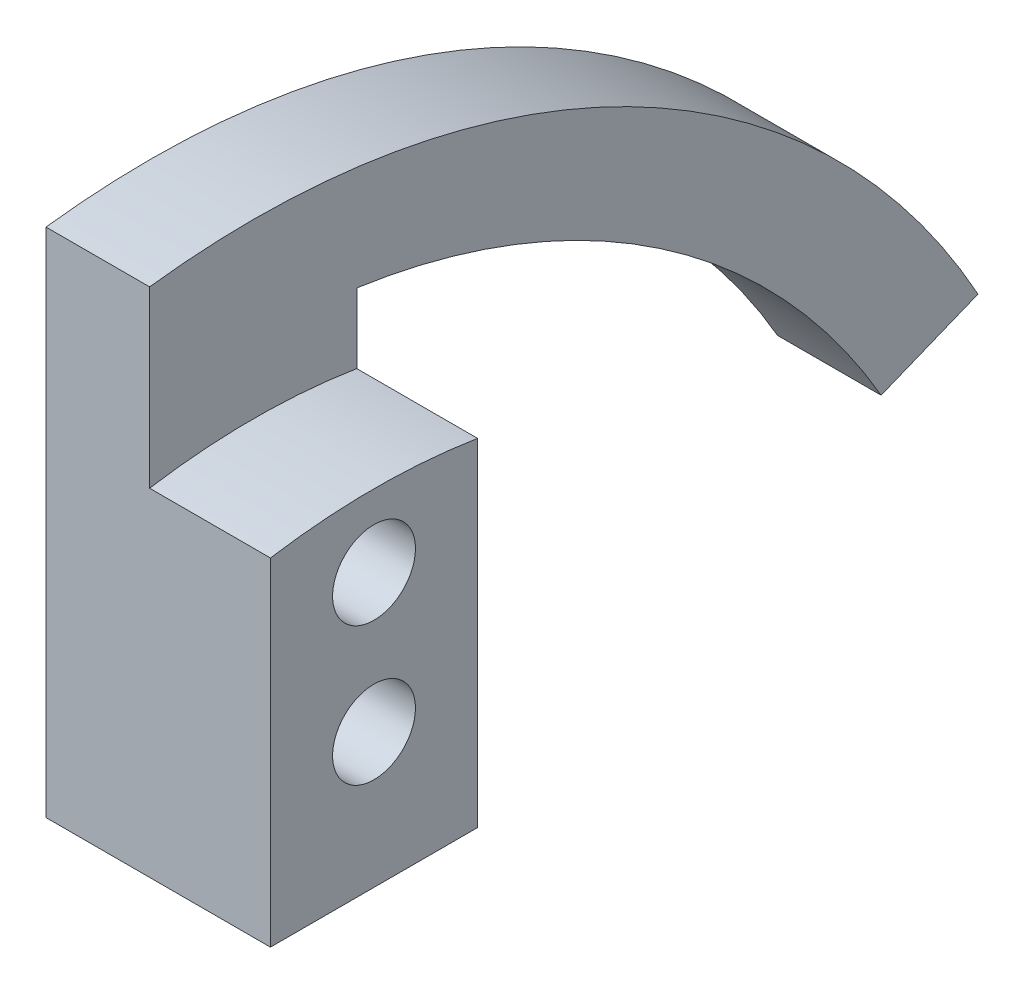
ISO-10303-21;
HEADER;
FILE_DESCRIPTION(('STEP AP214'),'2;1');
FILE_NAME('part.step','',(''),(''),'','','');
FILE_SCHEMA(('AUTOMOTIVE_DESIGN { 1 0 10303 214 1 1 1 1 }'));
ENDSEC;
DATA;
#1=APPLICATION_CONTEXT('core data for automotive mechanical design processes');
#2=APPLICATION_PROTOCOL_DEFINITION('international standard','automotive_design',2000,#1);
#3=PRODUCT_CONTEXT('',#1,'mechanical');
#4=PRODUCT('Part','Part','',(#3));
#5=PRODUCT_RELATED_PRODUCT_CATEGORY('part','',(#4));
#6=PRODUCT_DEFINITION_FORMATION('','',#4);
#7=PRODUCT_DEFINITION_CONTEXT('part definition',#1,'design');
#8=PRODUCT_DEFINITION('design','',#6,#7);
#9=PRODUCT_DEFINITION_SHAPE('','',#8);
#10=(LENGTH_UNIT() NAMED_UNIT(*) SI_UNIT(.MILLI.,.METRE.));
#11=(NAMED_UNIT(*) PLANE_ANGLE_UNIT() SI_UNIT($,.RADIAN.));
#12=(NAMED_UNIT(*) SI_UNIT($,.STERADIAN.) SOLID_ANGLE_UNIT());
#13=UNCERTAINTY_MEASURE_WITH_UNIT(LENGTH_MEASURE(1.E-05),#10,'distance_accuracy_value','');
#14=(GEOMETRIC_REPRESENTATION_CONTEXT(3) GLOBAL_UNCERTAINTY_ASSIGNED_CONTEXT((#13)) GLOBAL_UNIT_ASSIGNED_CONTEXT((#10,
#11,#12)) REPRESENTATION_CONTEXT('',''));
#15=CARTESIAN_POINT('',(0.,0.,0.));
#16=DIRECTION('',(0.,0.,1.));
#17=DIRECTION('',(1.,0.,0.));
#18=AXIS2_PLACEMENT_3D('',#15,#16,#17);
#19=CARTESIAN_POINT('',(1.5,0.,0.));
#20=DIRECTION('',(1.,0.,0.));
#21=DIRECTION('',(0.,0.,-1.));
#22=AXIS2_PLACEMENT_3D('',#19,#20,#21);
#23=PLANE('',#22);
#24=CARTESIAN_POINT('',(1.5,0.,0.));
#25=DIRECTION('',(1.,0.,0.));
#26=DIRECTION('',(0.,0.,-1.));
#27=AXIS2_PLACEMENT_3D('',#24,#25,#26);
#28=CIRCLE('',#27,9.5);
#29=CARTESIAN_POINT('',(1.5,9.38083151964686,-1.5));
#30=VERTEX_POINT('',#29);
#31=CARTESIAN_POINT('',(1.5,9.38083151964686,1.5));
#32=VERTEX_POINT('',#31);
#33=EDGE_CURVE('E48',#30,#32,#28,.T.);
#34=ORIENTED_EDGE('',*,*,#33,.F.);
#35=DIRECTION('',(0.,1.,0.));
#36=VECTOR('',#35,1.);
#37=CARTESIAN_POINT('',(1.5,4.5,-1.5));
#38=LINE('',#37,#36);
#39=CARTESIAN_POINT('',(1.5,10.3923048454133,-1.5));
#40=VERTEX_POINT('',#39);
#41=EDGE_CURVE('E86',#30,#40,#38,.T.);
#42=ORIENTED_EDGE('',*,*,#41,.T.);
#43=CARTESIAN_POINT('',(1.5,0.,0.));
#44=DIRECTION('',(-1.,0.,0.));
#45=DIRECTION('',(0.,0.,-1.));
#46=AXIS2_PLACEMENT_3D('',#43,#44,#45);
#47=CIRCLE('',#46,10.5);
#48=CARTESIAN_POINT('',(1.5,5.25000000000001,-9.0932667397366));
#49=VERTEX_POINT('',#48);
#50=EDGE_CURVE('E146',#40,#49,#47,.T.);
#51=ORIENTED_EDGE('',*,*,#50,.T.);
#52=DIRECTION('',(0.,0.374606593415913,-0.927183854566787));
#53=VECTOR('',#52,1.);
#54=CARTESIAN_POINT('',(1.5,5.25000000000001,-9.0932667397366));
#55=LINE('',#54,#53);
#56=CARTESIAN_POINT('',(1.5,5.81673328559829,-10.4959808443143));
#57=VERTEX_POINT('',#56);
#58=EDGE_CURVE('E148',#49,#57,#55,.T.);
#59=ORIENTED_EDGE('',*,*,#58,.T.);
#60=CARTESIAN_POINT('',(1.5,0.,0.));
#61=DIRECTION('',(1.,0.,0.));
#62=DIRECTION('',(0.,0.,-1.));
#63=AXIS2_PLACEMENT_3D('',#60,#61,#62);
#64=CIRCLE('',#63,12.);
#65=CARTESIAN_POINT('',(1.5,11.9058808997907,1.5));
#66=VERTEX_POINT('',#65);
#67=EDGE_CURVE('E55',#57,#66,#64,.T.);
#68=ORIENTED_EDGE('',*,*,#67,.T.);
#69=DIRECTION('',(0.,-1.,0.));
#70=VECTOR('',#69,1.);
#71=CARTESIAN_POINT('',(1.5,4.5,1.5));
#72=LINE('',#71,#70);
#73=EDGE_CURVE('E143',#66,#32,#72,.T.);
#74=ORIENTED_EDGE('',*,*,#73,.T.);
#75=EDGE_LOOP('',(#34,#42,#51,#59,#68,#74));
#76=FACE_BOUND('',#75,.T.);
#77=ADVANCED_FACE('F33',(#76),#23,.T.);
#78=CARTESIAN_POINT('',(0.,0.,0.));
#79=DIRECTION('',(1.,0.,0.));
#80=DIRECTION('',(0.,0.,-1.));
#81=AXIS2_PLACEMENT_3D('',#78,#79,#80);
#82=PLANE('',#81);
#83=DIRECTION('',(0.,-1.,0.));
#84=VECTOR('',#83,1.);
#85=CARTESIAN_POINT('',(0.,4.5,1.5));
#86=LINE('',#85,#84);
#87=CARTESIAN_POINT('',(0.,11.9058808997907,1.5));
#88=VERTEX_POINT('',#87);
#89=CARTESIAN_POINT('',(0.,4.5,1.5));
#90=VERTEX_POINT('',#89);
#91=EDGE_CURVE('E109',#88,#90,#86,.T.);
#92=ORIENTED_EDGE('',*,*,#91,.F.);
#93=CARTESIAN_POINT('',(0.,0.,0.));
#94=DIRECTION('',(1.,0.,0.));
#95=DIRECTION('',(0.,0.,-1.));
#96=AXIS2_PLACEMENT_3D('',#93,#94,#95);
#97=CIRCLE('',#96,12.);
#98=CARTESIAN_POINT('',(0.,5.81673328559829,-10.4959808443143));
#99=VERTEX_POINT('',#98);
#100=EDGE_CURVE('E82',#99,#88,#97,.T.);
#101=ORIENTED_EDGE('',*,*,#100,.F.);
#102=DIRECTION('',(0.,0.374606593415913,-0.927183854566787));
#103=VECTOR('',#102,1.);
#104=CARTESIAN_POINT('',(0.,5.25000000000001,-9.0932667397366));
#105=LINE('',#104,#103);
#106=CARTESIAN_POINT('',(0.,5.25000000000001,-9.0932667397366));
#107=VERTEX_POINT('',#106);
#108=EDGE_CURVE('E159',#107,#99,#105,.T.);
#109=ORIENTED_EDGE('',*,*,#108,.F.);
#110=CARTESIAN_POINT('',(0.,0.,0.));
#111=DIRECTION('',(-1.,0.,0.));
#112=DIRECTION('',(0.,0.,-1.));
#113=AXIS2_PLACEMENT_3D('',#110,#111,#112);
#114=CIRCLE('',#113,10.5);
#115=CARTESIAN_POINT('',(0.,10.3923048454133,-1.5));
#116=VERTEX_POINT('',#115);
#117=EDGE_CURVE('E157',#116,#107,#114,.T.);
#118=ORIENTED_EDGE('',*,*,#117,.F.);
#119=DIRECTION('',(0.,1.,0.));
#120=VECTOR('',#119,1.);
#121=CARTESIAN_POINT('',(0.,4.5,-1.5));
#122=LINE('',#121,#120);
#123=CARTESIAN_POINT('',(0.,4.5,-1.5));
#124=VERTEX_POINT('',#123);
#125=EDGE_CURVE('E155',#124,#116,#122,.T.);
#126=ORIENTED_EDGE('',*,*,#125,.F.);
#127=DIRECTION('',(0.,0.,-1.));
#128=VECTOR('',#127,1.);
#129=CARTESIAN_POINT('',(0.,4.5,1.5));
#130=LINE('',#129,#128);
#131=EDGE_CURVE('E153',#90,#124,#130,.T.);
#132=ORIENTED_EDGE('',*,*,#131,.F.);
#133=EDGE_LOOP('',(#92,#101,#109,#118,#126,#132));
#134=FACE_BOUND('',#133,.T.);
#135=CARTESIAN_POINT('',(0.,8.45,0.));
#136=DIRECTION('',(1.,0.,0.));
#137=DIRECTION('',(0.,0.,-1.));
#138=AXIS2_PLACEMENT_3D('',#135,#136,#137);
#139=CIRCLE('',#138,0.6);
#140=CARTESIAN_POINT('',(0.,8.45,-0.6));
#141=VERTEX_POINT('',#140);
#142=EDGE_CURVE('E140',#141,#141,#139,.T.);
#143=ORIENTED_EDGE('',*,*,#142,.T.);
#144=EDGE_LOOP('',(#143));
#145=FACE_BOUND('',#144,.T.);
#146=CARTESIAN_POINT('',(0.,6.45,0.));
#147=DIRECTION('',(1.,0.,0.));
#148=DIRECTION('',(0.,0.,-1.));
#149=AXIS2_PLACEMENT_3D('',#146,#147,#148);
#150=CIRCLE('',#149,0.6);
#151=CARTESIAN_POINT('',(0.,6.45,-0.6));
#152=VERTEX_POINT('',#151);
#153=EDGE_CURVE('E137',#152,#152,#150,.T.);
#154=ORIENTED_EDGE('',*,*,#153,.T.);
#155=EDGE_LOOP('',(#154));
#156=FACE_BOUND('',#155,.T.);
#157=ADVANCED_FACE('F176',(#134,#145,#156),#82,.F.);
#158=CARTESIAN_POINT('',(1.5,4.5,1.5));
#159=DIRECTION('',(0.,0.,-1.));
#160=DIRECTION('',(0.,1.,0.));
#161=AXIS2_PLACEMENT_3D('',#158,#159,#160);
#162=PLANE('',#161);
#163=ORIENTED_EDGE('',*,*,#91,.T.);
#164=DIRECTION('',(-1.,0.,0.));
#165=VECTOR('',#164,1.);
#166=CARTESIAN_POINT('',(1.5,4.5,1.5));
#167=LINE('',#166,#165);
#168=CARTESIAN_POINT('',(3.25,4.5,1.5));
#169=VERTEX_POINT('',#168);
#170=EDGE_CURVE('E11',#169,#90,#167,.T.);
#171=ORIENTED_EDGE('',*,*,#170,.F.);
#172=DIRECTION('',(0.,-1.,0.));
#173=VECTOR('',#172,1.);
#174=CARTESIAN_POINT('',(3.25,9.38083151964686,1.5));
#175=LINE('',#174,#173);
#176=CARTESIAN_POINT('',(3.25,9.38083151964686,1.5));
#177=VERTEX_POINT('',#176);
#178=EDGE_CURVE('E107',#177,#169,#175,.T.);
#179=ORIENTED_EDGE('',*,*,#178,.F.);
#180=DIRECTION('',(-1.,0.,0.));
#181=VECTOR('',#180,1.);
#182=CARTESIAN_POINT('',(3.25,9.38083151964686,1.5));
#183=LINE('',#182,#181);
#184=EDGE_CURVE('E131',#177,#32,#183,.T.);
#185=ORIENTED_EDGE('',*,*,#184,.T.);
#186=ORIENTED_EDGE('',*,*,#73,.F.);
#187=DIRECTION('',(-1.,0.,0.));
#188=VECTOR('',#187,1.);
#189=CARTESIAN_POINT('',(1.5,11.9058808997907,1.5));
#190=LINE('',#189,#188);
#191=EDGE_CURVE('E151',#66,#88,#190,.T.);
#192=ORIENTED_EDGE('',*,*,#191,.T.);
#193=EDGE_LOOP('',(#163,#171,#179,#185,#186,#192));
#194=FACE_BOUND('',#193,.T.);
#195=ADVANCED_FACE('F35',(#194),#162,.F.);
#196=CARTESIAN_POINT('',(1.5,4.5,1.5));
#197=DIRECTION('',(0.,1.,0.));
#198=DIRECTION('',(0.,0.,1.));
#199=AXIS2_PLACEMENT_3D('',#196,#197,#198);
#200=PLANE('',#199);
#201=ORIENTED_EDGE('',*,*,#131,.T.);
#202=DIRECTION('',(-1.,0.,0.));
#203=VECTOR('',#202,1.);
#204=CARTESIAN_POINT('',(1.5,4.5,-1.5));
#205=LINE('',#204,#203);
#206=CARTESIAN_POINT('',(3.25,4.5,-1.5));
#207=VERTEX_POINT('',#206);
#208=EDGE_CURVE('E41',#207,#124,#205,.T.);
#209=ORIENTED_EDGE('',*,*,#208,.F.);
#210=DIRECTION('',(0.,0.,-1.));
#211=VECTOR('',#210,1.);
#212=CARTESIAN_POINT('',(3.25,4.5,1.5));
#213=LINE('',#212,#211);
#214=EDGE_CURVE('E112',#169,#207,#213,.T.);
#215=ORIENTED_EDGE('',*,*,#214,.F.);
#216=ORIENTED_EDGE('',*,*,#170,.T.);
#217=EDGE_LOOP('',(#201,#209,#215,#216));
#218=FACE_BOUND('',#217,.T.);
#219=ADVANCED_FACE('F113',(#218),#200,.F.);
#220=CARTESIAN_POINT('',(1.5,4.5,-1.5));
#221=DIRECTION('',(0.,0.,1.));
#222=DIRECTION('',(0.,-1.,0.));
#223=AXIS2_PLACEMENT_3D('',#220,#221,#222);
#224=PLANE('',#223);
#225=ORIENTED_EDGE('',*,*,#125,.T.);
#226=DIRECTION('',(-1.,0.,0.));
#227=VECTOR('',#226,1.);
#228=CARTESIAN_POINT('',(1.5,10.3923048454133,-1.5));
#229=LINE('',#228,#227);
#230=EDGE_CURVE('E168',#40,#116,#229,.T.);
#231=ORIENTED_EDGE('',*,*,#230,.F.);
#232=ORIENTED_EDGE('',*,*,#41,.F.);
#233=DIRECTION('',(-1.,0.,0.));
#234=VECTOR('',#233,1.);
#235=CARTESIAN_POINT('',(3.25,9.38083151964686,-1.5));
#236=LINE('',#235,#234);
#237=CARTESIAN_POINT('',(3.25,9.38083151964686,-1.5));
#238=VERTEX_POINT('',#237);
#239=EDGE_CURVE('E134',#238,#30,#236,.T.);
#240=ORIENTED_EDGE('',*,*,#239,.F.);
#241=DIRECTION('',(0.,1.,0.));
#242=VECTOR('',#241,1.);
#243=CARTESIAN_POINT('',(3.25,4.5,-1.5));
#244=LINE('',#243,#242);
#245=EDGE_CURVE('E117',#207,#238,#244,.T.);
#246=ORIENTED_EDGE('',*,*,#245,.F.);
#247=ORIENTED_EDGE('',*,*,#208,.T.);
#248=EDGE_LOOP('',(#225,#231,#232,#240,#246,#247));
#249=FACE_BOUND('',#248,.T.);
#250=ADVANCED_FACE('F172',(#249),#224,.F.);
#251=CARTESIAN_POINT('',(1.5,0.,0.));
#252=DIRECTION('',(-1.,0.,0.));
#253=DIRECTION('',(0.,0.,1.));
#254=AXIS2_PLACEMENT_3D('',#251,#252,#253);
#255=CYLINDRICAL_SURFACE('',#254,10.5);
#256=ORIENTED_EDGE('',*,*,#117,.T.);
#257=DIRECTION('',(-1.,0.,0.));
#258=VECTOR('',#257,1.);
#259=CARTESIAN_POINT('',(1.5,5.25000000000001,-9.0932667397366));
#260=LINE('',#259,#258);
#261=EDGE_CURVE('E165',#49,#107,#260,.T.);
#262=ORIENTED_EDGE('',*,*,#261,.F.);
#263=ORIENTED_EDGE('',*,*,#50,.F.);
#264=ORIENTED_EDGE('',*,*,#230,.T.);
#265=EDGE_LOOP('',(#256,#262,#263,#264));
#266=FACE_BOUND('',#265,.T.);
#267=ADVANCED_FACE('F181',(#266),#255,.F.);
#268=CARTESIAN_POINT('',(1.5,5.25000000000001,-9.0932667397366));
#269=DIRECTION('',(0.,0.927183854566787,0.374606593415913));
#270=DIRECTION('',(0.,-0.374606593415913,0.927183854566787));
#271=AXIS2_PLACEMENT_3D('',#268,#269,#270);
#272=PLANE('',#271);
#273=ORIENTED_EDGE('',*,*,#108,.T.);
#274=DIRECTION('',(-1.,0.,0.));
#275=VECTOR('',#274,1.);
#276=CARTESIAN_POINT('',(1.5,5.81673328559829,-10.4959808443143));
#277=LINE('',#276,#275);
#278=EDGE_CURVE('E163',#57,#99,#277,.T.);
#279=ORIENTED_EDGE('',*,*,#278,.F.);
#280=ORIENTED_EDGE('',*,*,#58,.F.);
#281=ORIENTED_EDGE('',*,*,#261,.T.);
#282=EDGE_LOOP('',(#273,#279,#280,#281));
#283=FACE_BOUND('',#282,.T.);
#284=ADVANCED_FACE('F185',(#283),#272,.F.);
#285=CARTESIAN_POINT('',(1.5,0.,0.));
#286=DIRECTION('',(-1.,0.,0.));
#287=DIRECTION('',(0.,0.,1.));
#288=AXIS2_PLACEMENT_3D('',#285,#286,#287);
#289=CYLINDRICAL_SURFACE('',#288,12.);
#290=ORIENTED_EDGE('',*,*,#100,.T.);
#291=ORIENTED_EDGE('',*,*,#191,.F.);
#292=ORIENTED_EDGE('',*,*,#67,.F.);
#293=ORIENTED_EDGE('',*,*,#278,.T.);
#294=EDGE_LOOP('',(#290,#291,#292,#293));
#295=FACE_BOUND('',#294,.T.);
#296=ADVANCED_FACE('F197',(#295),#289,.T.);
#297=CARTESIAN_POINT('',(1.5,8.45,0.));
#298=DIRECTION('',(-1.,0.,0.));
#299=DIRECTION('',(0.,0.,1.));
#300=AXIS2_PLACEMENT_3D('',#297,#298,#299);
#301=CYLINDRICAL_SURFACE('',#300,0.6);
#302=ORIENTED_EDGE('',*,*,#142,.F.);
#303=EDGE_LOOP('',(#302));
#304=FACE_BOUND('',#303,.T.);
#305=CARTESIAN_POINT('',(3.25,8.45,0.));
#306=DIRECTION('',(1.,0.,0.));
#307=DIRECTION('',(0.,0.,-1.));
#308=AXIS2_PLACEMENT_3D('',#305,#306,#307);
#309=CIRCLE('',#308,0.6);
#310=CARTESIAN_POINT('',(3.25,8.45,-0.6));
#311=VERTEX_POINT('',#310);
#312=EDGE_CURVE('E308',#311,#311,#309,.T.);
#313=ORIENTED_EDGE('',*,*,#312,.T.);
#314=EDGE_LOOP('',(#313));
#315=FACE_BOUND('',#314,.T.);
#316=ADVANCED_FACE('F194',(#304,#315),#301,.F.);
#317=CARTESIAN_POINT('',(1.5,6.45,0.));
#318=DIRECTION('',(-1.,0.,0.));
#319=DIRECTION('',(0.,0.,1.));
#320=AXIS2_PLACEMENT_3D('',#317,#318,#319);
#321=CYLINDRICAL_SURFACE('',#320,0.6);
#322=ORIENTED_EDGE('',*,*,#153,.F.);
#323=EDGE_LOOP('',(#322));
#324=FACE_BOUND('',#323,.T.);
#325=CARTESIAN_POINT('',(3.25,6.45,0.));
#326=DIRECTION('',(1.,0.,0.));
#327=DIRECTION('',(0.,0.,-1.));
#328=AXIS2_PLACEMENT_3D('',#325,#326,#327);
#329=CIRCLE('',#328,0.6);
#330=CARTESIAN_POINT('',(3.25,6.45,-0.6));
#331=VERTEX_POINT('',#330);
#332=EDGE_CURVE('E125',#331,#331,#329,.T.);
#333=ORIENTED_EDGE('',*,*,#332,.T.);
#334=EDGE_LOOP('',(#333));
#335=FACE_BOUND('',#334,.T.);
#336=ADVANCED_FACE('F248',(#324,#335),#321,.F.);
#337=CARTESIAN_POINT('',(3.25,0.,0.));
#338=DIRECTION('',(1.,0.,0.));
#339=DIRECTION('',(0.,0.,-1.));
#340=AXIS2_PLACEMENT_3D('',#337,#338,#339);
#341=PLANE('',#340);
#342=ORIENTED_EDGE('',*,*,#332,.F.);
#343=EDGE_LOOP('',(#342));
#344=FACE_BOUND('',#343,.T.);
#345=ORIENTED_EDGE('',*,*,#178,.T.);
#346=ORIENTED_EDGE('',*,*,#214,.T.);
#347=ORIENTED_EDGE('',*,*,#245,.T.);
#348=CARTESIAN_POINT('',(3.25,0.,0.));
#349=DIRECTION('',(1.,0.,0.));
#350=DIRECTION('',(0.,0.,-1.));
#351=AXIS2_PLACEMENT_3D('',#348,#349,#350);
#352=CIRCLE('',#351,9.5);
#353=EDGE_CURVE('E122',#238,#177,#352,.T.);
#354=ORIENTED_EDGE('',*,*,#353,.T.);
#355=EDGE_LOOP('',(#345,#346,#347,#354));
#356=FACE_BOUND('',#355,.T.);
#357=ORIENTED_EDGE('',*,*,#312,.F.);
#358=EDGE_LOOP('',(#357));
#359=FACE_BOUND('',#358,.T.);
#360=ADVANCED_FACE('F119',(#344,#356,#359),#341,.T.);
#361=CARTESIAN_POINT('',(3.25,0.,0.));
#362=DIRECTION('',(-1.,0.,0.));
#363=DIRECTION('',(0.,0.,1.));
#364=AXIS2_PLACEMENT_3D('',#361,#362,#363);
#365=CYLINDRICAL_SURFACE('',#364,9.5);
#366=ORIENTED_EDGE('',*,*,#33,.T.);
#367=ORIENTED_EDGE('',*,*,#184,.F.);
#368=ORIENTED_EDGE('',*,*,#353,.F.);
#369=ORIENTED_EDGE('',*,*,#239,.T.);
#370=EDGE_LOOP('',(#366,#367,#368,#369));
#371=FACE_BOUND('',#370,.T.);
#372=ADVANCED_FACE('F262',(#371),#365,.T.);
#373=CLOSED_SHELL('',(#77,#157,#195,#219,#250,#267,#284,#296,#316,#336,#360,#372));
#374=MANIFOLD_SOLID_BREP('B2',#373);
#375=ADVANCED_BREP_SHAPE_REPRESENTATION('',(#18,#374),#14);
#376=SHAPE_DEFINITION_REPRESENTATION(#9,#375);
ENDSEC;
END-ISO-10303-21;
